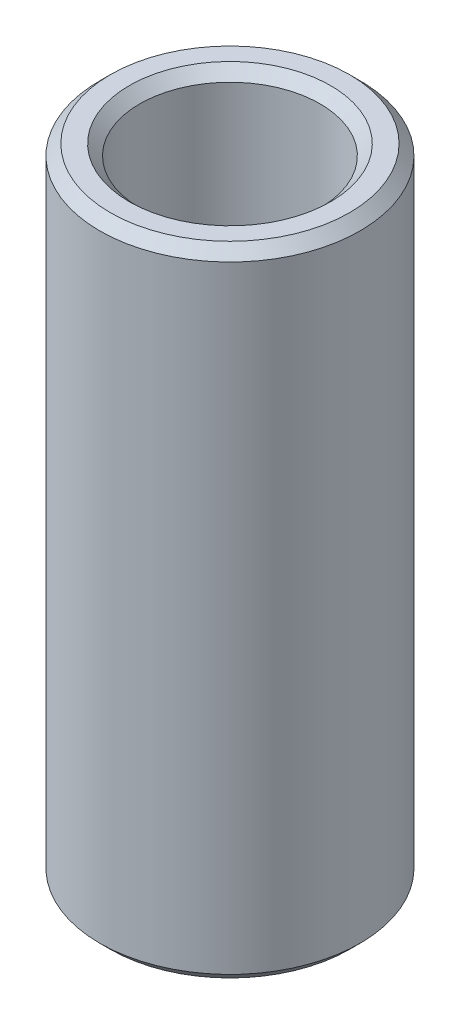
ISO-10303-21;
HEADER;
FILE_DESCRIPTION(('STEP AP214'),'2;1');
FILE_NAME('part.step','',(''),(''),'','','');
FILE_SCHEMA(('AUTOMOTIVE_DESIGN { 1 0 10303 214 1 1 1 1 }'));
ENDSEC;
DATA;
#1=APPLICATION_CONTEXT('core data for automotive mechanical design processes');
#2=APPLICATION_PROTOCOL_DEFINITION('international standard','automotive_design',2000,#1);
#3=PRODUCT_CONTEXT('',#1,'mechanical');
#4=PRODUCT('Part','Part','',(#3));
#5=PRODUCT_RELATED_PRODUCT_CATEGORY('part','',(#4));
#6=PRODUCT_DEFINITION_FORMATION('','',#4);
#7=PRODUCT_DEFINITION_CONTEXT('part definition',#1,'design');
#8=PRODUCT_DEFINITION('design','',#6,#7);
#9=PRODUCT_DEFINITION_SHAPE('','',#8);
#10=(LENGTH_UNIT() NAMED_UNIT(*) SI_UNIT(.MILLI.,.METRE.));
#11=(NAMED_UNIT(*) PLANE_ANGLE_UNIT() SI_UNIT($,.RADIAN.));
#12=(NAMED_UNIT(*) SI_UNIT($,.STERADIAN.) SOLID_ANGLE_UNIT());
#13=UNCERTAINTY_MEASURE_WITH_UNIT(LENGTH_MEASURE(1.E-05),#10,'distance_accuracy_value','');
#14=(GEOMETRIC_REPRESENTATION_CONTEXT(3) GLOBAL_UNCERTAINTY_ASSIGNED_CONTEXT((#13)) GLOBAL_UNIT_ASSIGNED_CONTEXT((#10,
#11,#12)) REPRESENTATION_CONTEXT('',''));
#15=CARTESIAN_POINT('',(0.,0.,0.));
#16=DIRECTION('',(0.,0.,1.));
#17=DIRECTION('',(1.,0.,0.));
#18=AXIS2_PLACEMENT_3D('',#15,#16,#17);
#19=CARTESIAN_POINT('',(0.,147.086436941041,0.));
#20=DIRECTION('',(0.,-1.,0.));
#21=DIRECTION('',(0.,0.,-1.));
#22=AXIS2_PLACEMENT_3D('',#19,#20,#21);
#23=CYLINDRICAL_SURFACE('',#22,30.);
#24=CARTESIAN_POINT('',(0.,2.42663605886156,0.));
#25=DIRECTION('',(0.,1.,0.));
#26=DIRECTION('',(0.,0.,1.));
#27=AXIS2_PLACEMENT_3D('',#24,#25,#26);
#28=CIRCLE('',#27,30.);
#29=CARTESIAN_POINT('',(0.,2.42663605886156,30.));
#30=VERTEX_POINT('',#29);
#31=EDGE_CURVE('E10',#30,#30,#28,.T.);
#32=ORIENTED_EDGE('',*,*,#31,.T.);
#33=EDGE_LOOP('',(#32));
#34=FACE_BOUND('',#33,.T.);
#35=CARTESIAN_POINT('',(0.,144.65980088218,0.));
#36=DIRECTION('',(0.,1.,0.));
#37=DIRECTION('',(0.,0.,1.));
#38=AXIS2_PLACEMENT_3D('',#35,#36,#37);
#39=CIRCLE('',#38,30.);
#40=CARTESIAN_POINT('',(0.,144.65980088218,30.));
#41=VERTEX_POINT('',#40);
#42=EDGE_CURVE('E50',#41,#41,#39,.F.);
#43=ORIENTED_EDGE('',*,*,#42,.T.);
#44=EDGE_LOOP('',(#43));
#45=FACE_BOUND('',#44,.T.);
#46=ADVANCED_FACE('F39',(#34,#45),#23,.T.);
#47=CARTESIAN_POINT('',(0.,147.086436941041,0.));
#48=DIRECTION('',(0.,1.,0.));
#49=DIRECTION('',(0.,0.,1.));
#50=AXIS2_PLACEMENT_3D('',#47,#48,#49);
#51=PLANE('',#50);
#52=CARTESIAN_POINT('',(0.,147.086436941041,0.));
#53=DIRECTION('',(0.,1.,0.));
#54=DIRECTION('',(0.,0.,1.));
#55=AXIS2_PLACEMENT_3D('',#52,#53,#54);
#56=CIRCLE('',#55,23.2075014940456);
#57=CARTESIAN_POINT('',(0.,147.086436941041,23.2075014940456));
#58=VERTEX_POINT('',#57);
#59=EDGE_CURVE('E58',#58,#58,#56,.F.);
#60=ORIENTED_EDGE('',*,*,#59,.T.);
#61=EDGE_LOOP('',(#60));
#62=FACE_BOUND('',#61,.T.);
#63=CARTESIAN_POINT('',(0.,147.086436941041,0.));
#64=DIRECTION('',(0.,1.,0.));
#65=DIRECTION('',(0.,0.,1.));
#66=AXIS2_PLACEMENT_3D('',#63,#64,#65);
#67=CIRCLE('',#66,27.5733639411385);
#68=CARTESIAN_POINT('',(0.,147.086436941041,27.5733639411385));
#69=VERTEX_POINT('',#68);
#70=EDGE_CURVE('E61',#69,#69,#67,.T.);
#71=ORIENTED_EDGE('',*,*,#70,.T.);
#72=EDGE_LOOP('',(#71));
#73=FACE_BOUND('',#72,.T.);
#74=ADVANCED_FACE('F88',(#62,#73),#51,.T.);
#75=CARTESIAN_POINT('',(0.,0.,0.));
#76=DIRECTION('',(0.,1.,0.));
#77=DIRECTION('',(0.,0.,1.));
#78=AXIS2_PLACEMENT_3D('',#75,#76,#77);
#79=PLANE('',#78);
#80=CARTESIAN_POINT('',(0.,0.,0.));
#81=DIRECTION('',(0.,1.,0.));
#82=DIRECTION('',(0.,0.,1.));
#83=AXIS2_PLACEMENT_3D('',#80,#81,#82);
#84=CIRCLE('',#83,23.2075014940457);
#85=CARTESIAN_POINT('',(0.,0.,23.2075014940457));
#86=VERTEX_POINT('',#85);
#87=EDGE_CURVE('E51',#86,#86,#84,.T.);
#88=ORIENTED_EDGE('',*,*,#87,.T.);
#89=EDGE_LOOP('',(#88));
#90=FACE_BOUND('',#89,.T.);
#91=CARTESIAN_POINT('',(0.,0.,0.));
#92=DIRECTION('',(0.,1.,0.));
#93=DIRECTION('',(0.,0.,1.));
#94=AXIS2_PLACEMENT_3D('',#91,#92,#93);
#95=CIRCLE('',#94,27.5733639411384);
#96=CARTESIAN_POINT('',(0.,0.,27.5733639411384));
#97=VERTEX_POINT('',#96);
#98=EDGE_CURVE('E54',#97,#97,#95,.F.);
#99=ORIENTED_EDGE('',*,*,#98,.T.);
#100=EDGE_LOOP('',(#99));
#101=FACE_BOUND('',#100,.T.);
#102=ADVANCED_FACE('F83',(#90,#101),#79,.F.);
#103=CARTESIAN_POINT('',(0.,147.086436941041,0.));
#104=DIRECTION('',(0.,-1.,0.));
#105=DIRECTION('',(0.,0.,-1.));
#106=AXIS2_PLACEMENT_3D('',#103,#104,#105);
#107=CYLINDRICAL_SURFACE('',#106,20.7808654351842);
#108=CARTESIAN_POINT('',(0.,144.65980088218,0.));
#109=DIRECTION('',(0.,1.,0.));
#110=DIRECTION('',(0.,0.,1.));
#111=AXIS2_PLACEMENT_3D('',#108,#109,#110);
#112=CIRCLE('',#111,20.7808654351842);
#113=CARTESIAN_POINT('',(0.,144.65980088218,20.7808654351842));
#114=VERTEX_POINT('',#113);
#115=EDGE_CURVE('E67',#114,#114,#112,.T.);
#116=ORIENTED_EDGE('',*,*,#115,.T.);
#117=EDGE_LOOP('',(#116));
#118=FACE_BOUND('',#117,.T.);
#119=CARTESIAN_POINT('',(0.,2.42663605886151,0.));
#120=DIRECTION('',(0.,1.,0.));
#121=DIRECTION('',(0.,0.,1.));
#122=AXIS2_PLACEMENT_3D('',#119,#120,#121);
#123=CIRCLE('',#122,20.7808654351842);
#124=CARTESIAN_POINT('',(0.,2.42663605886151,20.7808654351842));
#125=VERTEX_POINT('',#124);
#126=EDGE_CURVE('E69',#125,#125,#123,.F.);
#127=ORIENTED_EDGE('',*,*,#126,.T.);
#128=EDGE_LOOP('',(#127));
#129=FACE_BOUND('',#128,.T.);
#130=ADVANCED_FACE('F71',(#118,#129),#107,.F.);
#131=CARTESIAN_POINT('',(0.,144.65980088218,0.));
#132=DIRECTION('',(0.,1.,0.));
#133=DIRECTION('',(0.,0.,1.));
#134=AXIS2_PLACEMENT_3D('',#131,#132,#133);
#135=CONICAL_SURFACE('',#134,20.7808654351842,0.785398163397447);
#136=ORIENTED_EDGE('',*,*,#59,.F.);
#137=EDGE_LOOP('',(#136));
#138=FACE_BOUND('',#137,.T.);
#139=ORIENTED_EDGE('',*,*,#115,.F.);
#140=EDGE_LOOP('',(#139));
#141=FACE_BOUND('',#140,.T.);
#142=ADVANCED_FACE('F77',(#138,#141),#135,.F.);
#143=CARTESIAN_POINT('',(0.,0.,0.));
#144=DIRECTION('',(0.,-1.,0.));
#145=DIRECTION('',(0.,0.,-1.));
#146=AXIS2_PLACEMENT_3D('',#143,#144,#145);
#147=CONICAL_SURFACE('',#146,23.2075014940457,0.785398163397447);
#148=ORIENTED_EDGE('',*,*,#126,.F.);
#149=EDGE_LOOP('',(#148));
#150=FACE_BOUND('',#149,.T.);
#151=ORIENTED_EDGE('',*,*,#87,.F.);
#152=EDGE_LOOP('',(#151));
#153=FACE_BOUND('',#152,.T.);
#154=ADVANCED_FACE('F73',(#150,#153),#147,.F.);
#155=CARTESIAN_POINT('',(0.,2.42663605886156,0.));
#156=DIRECTION('',(0.,1.,0.));
#157=DIRECTION('',(0.,0.,1.));
#158=AXIS2_PLACEMENT_3D('',#155,#156,#157);
#159=CONICAL_SURFACE('',#158,30.,0.785398163397457);
#160=ORIENTED_EDGE('',*,*,#98,.F.);
#161=EDGE_LOOP('',(#160));
#162=FACE_BOUND('',#161,.T.);
#163=ORIENTED_EDGE('',*,*,#31,.F.);
#164=EDGE_LOOP('',(#163));
#165=FACE_BOUND('',#164,.T.);
#166=ADVANCED_FACE('F76',(#162,#165),#159,.T.);
#167=CARTESIAN_POINT('',(0.,147.086436941041,0.));
#168=DIRECTION('',(0.,-1.,0.));
#169=DIRECTION('',(0.,0.,-1.));
#170=AXIS2_PLACEMENT_3D('',#167,#168,#169);
#171=CONICAL_SURFACE('',#170,27.5733639411385,0.785398163397448);
#172=ORIENTED_EDGE('',*,*,#42,.F.);
#173=EDGE_LOOP('',(#172));
#174=FACE_BOUND('',#173,.T.);
#175=ORIENTED_EDGE('',*,*,#70,.F.);
#176=EDGE_LOOP('',(#175));
#177=FACE_BOUND('',#176,.T.);
#178=ADVANCED_FACE('F45',(#174,#177),#171,.T.);
#179=CLOSED_SHELL('',(#46,#74,#102,#130,#142,#154,#166,#178));
#180=MANIFOLD_SOLID_BREP('B2',#179);
#181=ADVANCED_BREP_SHAPE_REPRESENTATION('',(#18,#180),#14);
#182=SHAPE_DEFINITION_REPRESENTATION(#9,#181);
ENDSEC;
END-ISO-10303-21;
